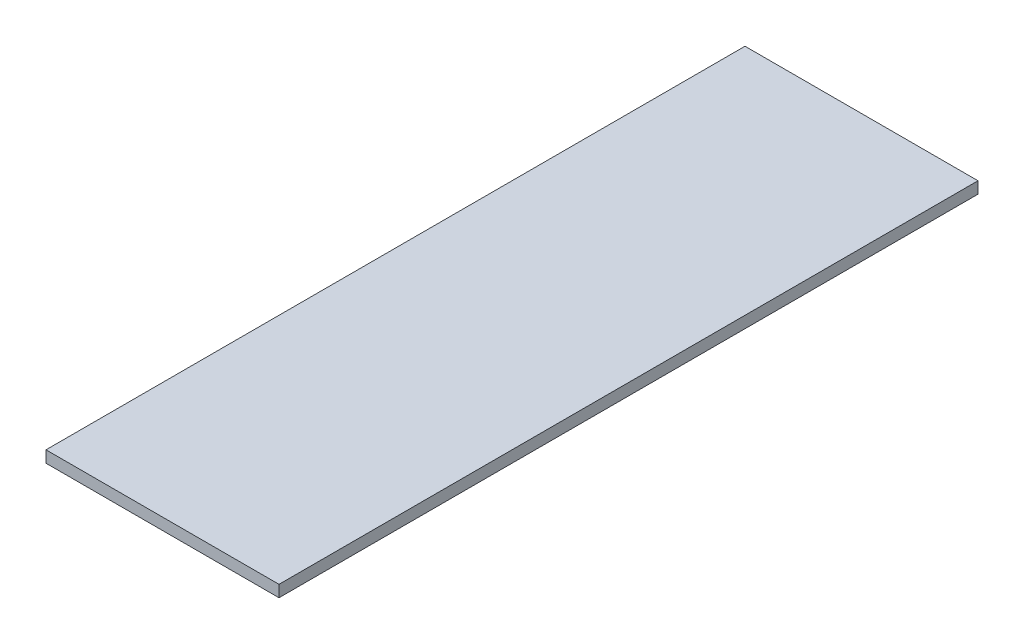
ISO-10303-21;
HEADER;
FILE_DESCRIPTION(('STEP AP214'),'2;1');
FILE_NAME('part.step','',(''),(''),'','','');
FILE_SCHEMA(('AUTOMOTIVE_DESIGN { 1 0 10303 214 1 1 1 1 }'));
ENDSEC;
DATA;
#1=APPLICATION_CONTEXT('core data for automotive mechanical design processes');
#2=APPLICATION_PROTOCOL_DEFINITION('international standard','automotive_design',2000,#1);
#3=PRODUCT_CONTEXT('',#1,'mechanical');
#4=PRODUCT('Part','Part','',(#3));
#5=PRODUCT_RELATED_PRODUCT_CATEGORY('part','',(#4));
#6=PRODUCT_DEFINITION_FORMATION('','',#4);
#7=PRODUCT_DEFINITION_CONTEXT('part definition',#1,'design');
#8=PRODUCT_DEFINITION('design','',#6,#7);
#9=PRODUCT_DEFINITION_SHAPE('','',#8);
#10=(LENGTH_UNIT() NAMED_UNIT(*) SI_UNIT(.MILLI.,.METRE.));
#11=(NAMED_UNIT(*) PLANE_ANGLE_UNIT() SI_UNIT($,.RADIAN.));
#12=(NAMED_UNIT(*) SI_UNIT($,.STERADIAN.) SOLID_ANGLE_UNIT());
#13=UNCERTAINTY_MEASURE_WITH_UNIT(LENGTH_MEASURE(1.E-05),#10,'distance_accuracy_value','');
#14=(GEOMETRIC_REPRESENTATION_CONTEXT(3) GLOBAL_UNCERTAINTY_ASSIGNED_CONTEXT((#13)) GLOBAL_UNIT_ASSIGNED_CONTEXT((#10,
#11,#12)) REPRESENTATION_CONTEXT('',''));
#15=CARTESIAN_POINT('',(0.,0.,0.));
#16=DIRECTION('',(0.,0.,1.));
#17=DIRECTION('',(1.,0.,0.));
#18=AXIS2_PLACEMENT_3D('',#15,#16,#17);
#19=CARTESIAN_POINT('',(50.,5.,150.));
#20=DIRECTION('',(-1.,0.,0.));
#21=DIRECTION('',(0.,0.,1.));
#22=AXIS2_PLACEMENT_3D('',#19,#20,#21);
#23=PLANE('',#22);
#24=DIRECTION('',(0.,0.,-1.));
#25=VECTOR('',#24,1.);
#26=CARTESIAN_POINT('',(50.,0.,150.));
#27=LINE('',#26,#25);
#28=CARTESIAN_POINT('',(50.,0.,150.));
#29=VERTEX_POINT('',#28);
#30=CARTESIAN_POINT('',(50.,0.,-150.));
#31=VERTEX_POINT('',#30);
#32=EDGE_CURVE('E100',#29,#31,#27,.T.);
#33=ORIENTED_EDGE('',*,*,#32,.T.);
#34=DIRECTION('',(0.,-1.,0.));
#35=VECTOR('',#34,1.);
#36=CARTESIAN_POINT('',(50.,5.,-150.));
#37=LINE('',#36,#35);
#38=CARTESIAN_POINT('',(50.,5.,-150.));
#39=VERTEX_POINT('',#38);
#40=EDGE_CURVE('E11',#39,#31,#37,.T.);
#41=ORIENTED_EDGE('',*,*,#40,.F.);
#42=DIRECTION('',(0.,0.,-1.));
#43=VECTOR('',#42,1.);
#44=CARTESIAN_POINT('',(50.,5.,150.));
#45=LINE('',#44,#43);
#46=CARTESIAN_POINT('',(50.,5.,150.));
#47=VERTEX_POINT('',#46);
#48=EDGE_CURVE('E88',#47,#39,#45,.T.);
#49=ORIENTED_EDGE('',*,*,#48,.F.);
#50=DIRECTION('',(0.,-1.,0.));
#51=VECTOR('',#50,1.);
#52=CARTESIAN_POINT('',(50.,5.,150.));
#53=LINE('',#52,#51);
#54=EDGE_CURVE('E96',#47,#29,#53,.T.);
#55=ORIENTED_EDGE('',*,*,#54,.T.);
#56=EDGE_LOOP('',(#33,#41,#49,#55));
#57=FACE_BOUND('',#56,.T.);
#58=ADVANCED_FACE('F37',(#57),#23,.F.);
#59=CARTESIAN_POINT('',(-50.,5.,-150.));
#60=DIRECTION('',(0.,0.,1.));
#61=DIRECTION('',(1.,0.,0.));
#62=AXIS2_PLACEMENT_3D('',#59,#60,#61);
#63=PLANE('',#62);
#64=DIRECTION('',(-1.,0.,0.));
#65=VECTOR('',#64,1.);
#66=CARTESIAN_POINT('',(-50.,0.,-150.));
#67=LINE('',#66,#65);
#68=CARTESIAN_POINT('',(-50.,0.,-150.));
#69=VERTEX_POINT('',#68);
#70=EDGE_CURVE('E92',#31,#69,#67,.T.);
#71=ORIENTED_EDGE('',*,*,#70,.T.);
#72=DIRECTION('',(0.,-1.,0.));
#73=VECTOR('',#72,1.);
#74=CARTESIAN_POINT('',(-50.,5.,-150.));
#75=LINE('',#74,#73);
#76=CARTESIAN_POINT('',(-50.,5.,-150.));
#77=VERTEX_POINT('',#76);
#78=EDGE_CURVE('E45',#77,#69,#75,.T.);
#79=ORIENTED_EDGE('',*,*,#78,.F.);
#80=DIRECTION('',(-1.,0.,0.));
#81=VECTOR('',#80,1.);
#82=CARTESIAN_POINT('',(-50.,5.,-150.));
#83=LINE('',#82,#81);
#84=EDGE_CURVE('E83',#39,#77,#83,.T.);
#85=ORIENTED_EDGE('',*,*,#84,.F.);
#86=ORIENTED_EDGE('',*,*,#40,.T.);
#87=EDGE_LOOP('',(#71,#79,#85,#86));
#88=FACE_BOUND('',#87,.T.);
#89=ADVANCED_FACE('F91',(#88),#63,.F.);
#90=CARTESIAN_POINT('',(-50.,5.,150.));
#91=DIRECTION('',(1.,0.,0.));
#92=DIRECTION('',(0.,0.,-1.));
#93=AXIS2_PLACEMENT_3D('',#90,#91,#92);
#94=PLANE('',#93);
#95=DIRECTION('',(0.,0.,1.));
#96=VECTOR('',#95,1.);
#97=CARTESIAN_POINT('',(-50.,0.,150.));
#98=LINE('',#97,#96);
#99=CARTESIAN_POINT('',(-50.,0.,150.));
#100=VERTEX_POINT('',#99);
#101=EDGE_CURVE('E70',#69,#100,#98,.T.);
#102=ORIENTED_EDGE('',*,*,#101,.T.);
#103=DIRECTION('',(0.,-1.,0.));
#104=VECTOR('',#103,1.);
#105=CARTESIAN_POINT('',(-50.,5.,150.));
#106=LINE('',#105,#104);
#107=CARTESIAN_POINT('',(-50.,5.,150.));
#108=VERTEX_POINT('',#107);
#109=EDGE_CURVE('E93',#108,#100,#106,.T.);
#110=ORIENTED_EDGE('',*,*,#109,.F.);
#111=DIRECTION('',(0.,0.,1.));
#112=VECTOR('',#111,1.);
#113=CARTESIAN_POINT('',(-50.,5.,150.));
#114=LINE('',#113,#112);
#115=EDGE_CURVE('E86',#77,#108,#114,.T.);
#116=ORIENTED_EDGE('',*,*,#115,.F.);
#117=ORIENTED_EDGE('',*,*,#78,.T.);
#118=EDGE_LOOP('',(#102,#110,#116,#117));
#119=FACE_BOUND('',#118,.T.);
#120=ADVANCED_FACE('F94',(#119),#94,.F.);
#121=CARTESIAN_POINT('',(-50.,5.,150.));
#122=DIRECTION('',(0.,0.,-1.));
#123=DIRECTION('',(-1.,0.,0.));
#124=AXIS2_PLACEMENT_3D('',#121,#122,#123);
#125=PLANE('',#124);
#126=DIRECTION('',(1.,0.,0.));
#127=VECTOR('',#126,1.);
#128=CARTESIAN_POINT('',(-50.,0.,150.));
#129=LINE('',#128,#127);
#130=EDGE_CURVE('E76',#100,#29,#129,.T.);
#131=ORIENTED_EDGE('',*,*,#130,.T.);
#132=ORIENTED_EDGE('',*,*,#54,.F.);
#133=DIRECTION('',(1.,0.,0.));
#134=VECTOR('',#133,1.);
#135=CARTESIAN_POINT('',(-50.,5.,150.));
#136=LINE('',#135,#134);
#137=EDGE_CURVE('E53',#108,#47,#136,.T.);
#138=ORIENTED_EDGE('',*,*,#137,.F.);
#139=ORIENTED_EDGE('',*,*,#109,.T.);
#140=EDGE_LOOP('',(#131,#132,#138,#139));
#141=FACE_BOUND('',#140,.T.);
#142=ADVANCED_FACE('F107',(#141),#125,.F.);
#143=CARTESIAN_POINT('',(0.,5.,0.));
#144=DIRECTION('',(0.,-1.,0.));
#145=DIRECTION('',(0.,0.,-1.));
#146=AXIS2_PLACEMENT_3D('',#143,#144,#145);
#147=PLANE('',#146);
#148=ORIENTED_EDGE('',*,*,#48,.T.);
#149=ORIENTED_EDGE('',*,*,#84,.T.);
#150=ORIENTED_EDGE('',*,*,#115,.T.);
#151=ORIENTED_EDGE('',*,*,#137,.T.);
#152=EDGE_LOOP('',(#148,#149,#150,#151));
#153=FACE_BOUND('',#152,.T.);
#154=ADVANCED_FACE('F84',(#153),#147,.F.);
#155=CARTESIAN_POINT('',(0.,0.,0.));
#156=DIRECTION('',(0.,-1.,0.));
#157=DIRECTION('',(0.,0.,-1.));
#158=AXIS2_PLACEMENT_3D('',#155,#156,#157);
#159=PLANE('',#158);
#160=ORIENTED_EDGE('',*,*,#32,.F.);
#161=ORIENTED_EDGE('',*,*,#130,.F.);
#162=ORIENTED_EDGE('',*,*,#101,.F.);
#163=ORIENTED_EDGE('',*,*,#70,.F.);
#164=EDGE_LOOP('',(#160,#161,#162,#163));
#165=FACE_BOUND('',#164,.T.);
#166=ADVANCED_FACE('F110',(#165),#159,.T.);
#167=CLOSED_SHELL('',(#58,#89,#120,#142,#154,#166));
#168=MANIFOLD_SOLID_BREP('B2',#167);
#169=ADVANCED_BREP_SHAPE_REPRESENTATION('',(#18,#168),#14);
#170=SHAPE_DEFINITION_REPRESENTATION(#9,#169);
ENDSEC;
END-ISO-10303-21;
